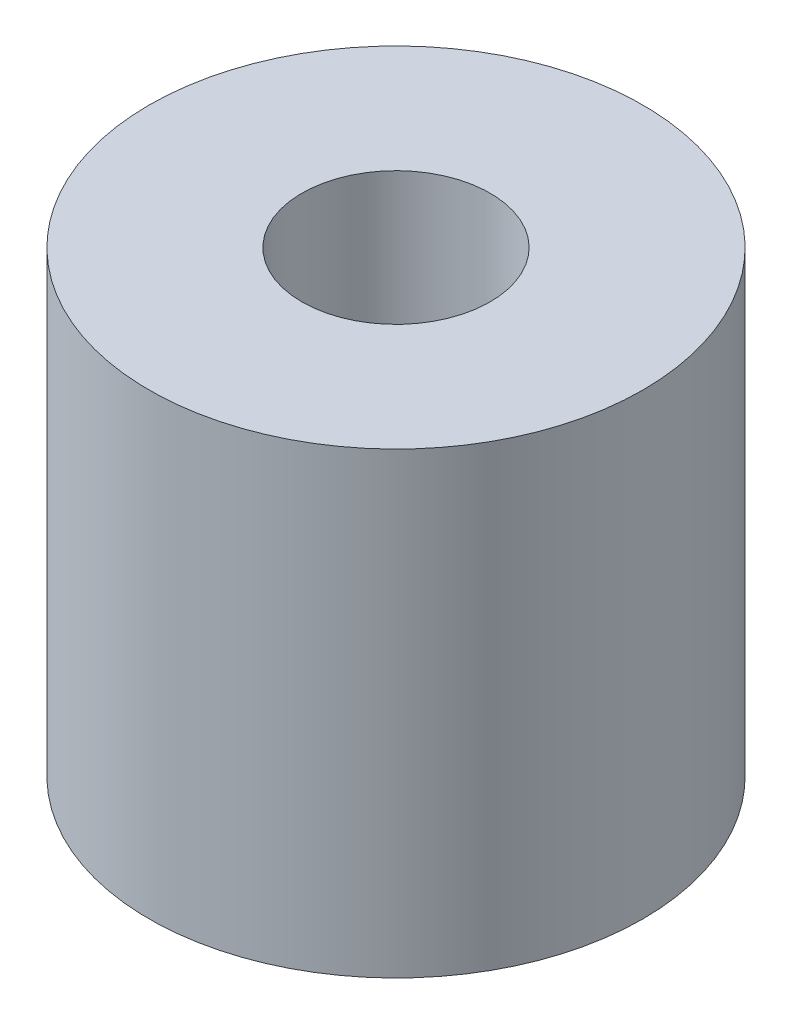
ISO-10303-21;
HEADER;
FILE_DESCRIPTION(('STEP AP214'),'2;1');
FILE_NAME('part.step','',(''),(''),'','','');
FILE_SCHEMA(('AUTOMOTIVE_DESIGN { 1 0 10303 214 1 1 1 1 }'));
ENDSEC;
DATA;
#1=APPLICATION_CONTEXT('core data for automotive mechanical design processes');
#2=APPLICATION_PROTOCOL_DEFINITION('international standard','automotive_design',2000,#1);
#3=PRODUCT_CONTEXT('',#1,'mechanical');
#4=PRODUCT('Part','Part','',(#3));
#5=PRODUCT_RELATED_PRODUCT_CATEGORY('part','',(#4));
#6=PRODUCT_DEFINITION_FORMATION('','',#4);
#7=PRODUCT_DEFINITION_CONTEXT('part definition',#1,'design');
#8=PRODUCT_DEFINITION('design','',#6,#7);
#9=PRODUCT_DEFINITION_SHAPE('','',#8);
#10=(LENGTH_UNIT() NAMED_UNIT(*) SI_UNIT(.MILLI.,.METRE.));
#11=(NAMED_UNIT(*) PLANE_ANGLE_UNIT() SI_UNIT($,.RADIAN.));
#12=(NAMED_UNIT(*) SI_UNIT($,.STERADIAN.) SOLID_ANGLE_UNIT());
#13=UNCERTAINTY_MEASURE_WITH_UNIT(LENGTH_MEASURE(1.E-05),#10,'distance_accuracy_value','');
#14=(GEOMETRIC_REPRESENTATION_CONTEXT(3) GLOBAL_UNCERTAINTY_ASSIGNED_CONTEXT((#13)) GLOBAL_UNIT_ASSIGNED_CONTEXT((#10,
#11,#12)) REPRESENTATION_CONTEXT('',''));
#15=CARTESIAN_POINT('',(0.,0.,0.));
#16=DIRECTION('',(0.,0.,1.));
#17=DIRECTION('',(1.,0.,0.));
#18=AXIS2_PLACEMENT_3D('',#15,#16,#17);
#19=CARTESIAN_POINT('',(0.,9.,0.));
#20=DIRECTION('',(0.,1.,0.));
#21=DIRECTION('',(0.,0.,1.));
#22=AXIS2_PLACEMENT_3D('',#19,#20,#21);
#23=PLANE('',#22);
#24=CARTESIAN_POINT('',(0.,9.,0.));
#25=DIRECTION('',(0.,1.,0.));
#26=DIRECTION('',(1.,0.,0.));
#27=AXIS2_PLACEMENT_3D('',#24,#25,#26);
#28=CIRCLE('',#27,4.85);
#29=CARTESIAN_POINT('',(4.85,9.,0.));
#30=VERTEX_POINT('',#29);
#31=EDGE_CURVE('E11',#30,#30,#28,.T.);
#32=ORIENTED_EDGE('',*,*,#31,.T.);
#33=EDGE_LOOP('',(#32));
#34=FACE_BOUND('',#33,.T.);
#35=CARTESIAN_POINT('',(0.,9.,0.));
#36=DIRECTION('',(0.,1.,0.));
#37=DIRECTION('',(0.,0.,1.));
#38=AXIS2_PLACEMENT_3D('',#35,#36,#37);
#39=CIRCLE('',#38,1.85);
#40=CARTESIAN_POINT('',(0.,9.,1.85));
#41=VERTEX_POINT('',#40);
#42=EDGE_CURVE('E56',#41,#41,#39,.T.);
#43=ORIENTED_EDGE('',*,*,#42,.F.);
#44=EDGE_LOOP('',(#43));
#45=FACE_BOUND('',#44,.T.);
#46=ADVANCED_FACE('F45',(#34,#45),#23,.T.);
#47=CARTESIAN_POINT('',(0.,0.,0.));
#48=DIRECTION('',(0.,1.,0.));
#49=DIRECTION('',(0.,0.,1.));
#50=AXIS2_PLACEMENT_3D('',#47,#48,#49);
#51=PLANE('',#50);
#52=CARTESIAN_POINT('',(0.,0.,0.));
#53=DIRECTION('',(0.,1.,0.));
#54=DIRECTION('',(1.,0.,0.));
#55=AXIS2_PLACEMENT_3D('',#52,#53,#54);
#56=CIRCLE('',#55,4.85);
#57=CARTESIAN_POINT('',(4.85,0.,0.));
#58=VERTEX_POINT('',#57);
#59=EDGE_CURVE('E49',#58,#58,#56,.T.);
#60=ORIENTED_EDGE('',*,*,#59,.F.);
#61=EDGE_LOOP('',(#60));
#62=FACE_BOUND('',#61,.T.);
#63=CARTESIAN_POINT('',(0.,0.,0.));
#64=DIRECTION('',(0.,1.,0.));
#65=DIRECTION('',(0.,0.,1.));
#66=AXIS2_PLACEMENT_3D('',#63,#64,#65);
#67=CIRCLE('',#66,1.85);
#68=CARTESIAN_POINT('',(0.,0.,1.85));
#69=VERTEX_POINT('',#68);
#70=EDGE_CURVE('E58',#69,#69,#67,.T.);
#71=ORIENTED_EDGE('',*,*,#70,.T.);
#72=EDGE_LOOP('',(#71));
#73=FACE_BOUND('',#72,.T.);
#74=ADVANCED_FACE('F68',(#62,#73),#51,.F.);
#75=CARTESIAN_POINT('',(0.,9.,0.));
#76=DIRECTION('',(0.,-1.,0.));
#77=DIRECTION('',(0.,0.,-1.));
#78=AXIS2_PLACEMENT_3D('',#75,#76,#77);
#79=CYLINDRICAL_SURFACE('',#78,4.85);
#80=ORIENTED_EDGE('',*,*,#31,.F.);
#81=EDGE_LOOP('',(#80));
#82=FACE_BOUND('',#81,.T.);
#83=ORIENTED_EDGE('',*,*,#59,.T.);
#84=EDGE_LOOP('',(#83));
#85=FACE_BOUND('',#84,.T.);
#86=ADVANCED_FACE('F47',(#82,#85),#79,.T.);
#87=CARTESIAN_POINT('',(0.,9.,0.));
#88=DIRECTION('',(0.,-1.,0.));
#89=DIRECTION('',(0.,0.,-1.));
#90=AXIS2_PLACEMENT_3D('',#87,#88,#89);
#91=CYLINDRICAL_SURFACE('',#90,1.85);
#92=ORIENTED_EDGE('',*,*,#42,.T.);
#93=EDGE_LOOP('',(#92));
#94=FACE_BOUND('',#93,.T.);
#95=ORIENTED_EDGE('',*,*,#70,.F.);
#96=EDGE_LOOP('',(#95));
#97=FACE_BOUND('',#96,.T.);
#98=ADVANCED_FACE('F64',(#94,#97),#91,.F.);
#99=CLOSED_SHELL('',(#46,#74,#86,#98));
#100=MANIFOLD_SOLID_BREP('B2',#99);
#101=ADVANCED_BREP_SHAPE_REPRESENTATION('',(#18,#100),#14);
#102=SHAPE_DEFINITION_REPRESENTATION(#9,#101);
ENDSEC;
END-ISO-10303-21;
